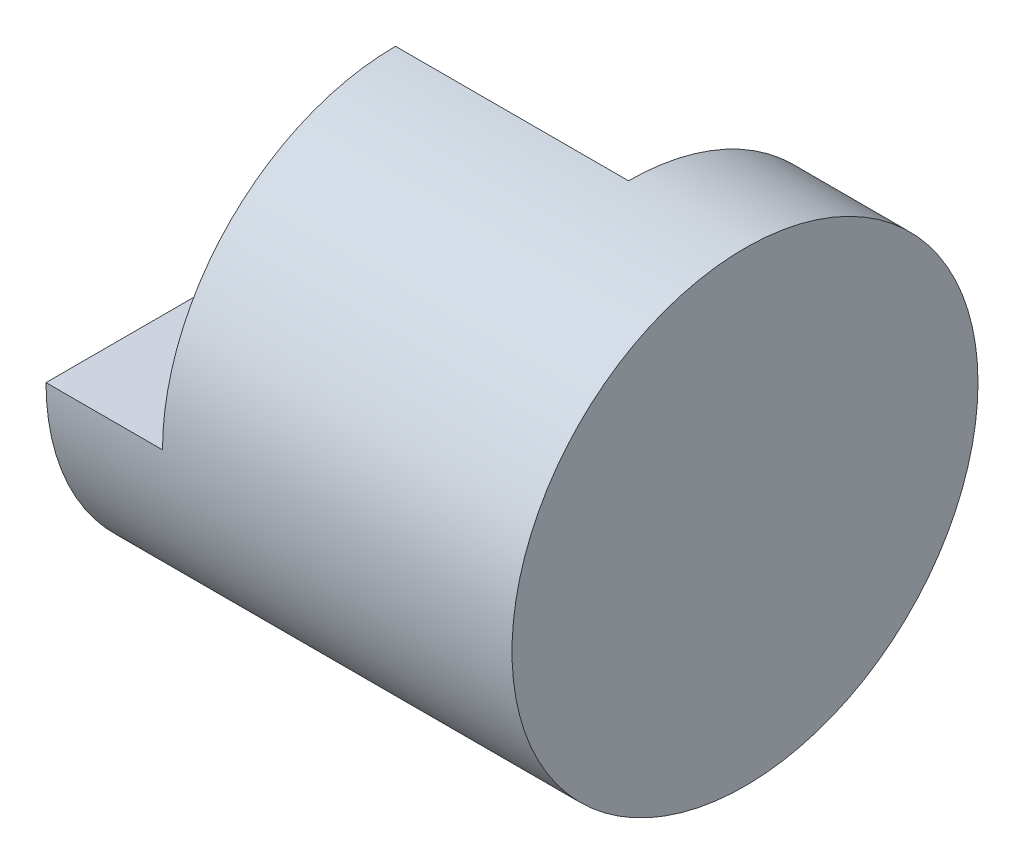
ISO-10303-21;
HEADER;
FILE_DESCRIPTION(('STEP AP214'),'2;1');
FILE_NAME('part.step','',(''),(''),'','','');
FILE_SCHEMA(('AUTOMOTIVE_DESIGN { 1 0 10303 214 1 1 1 1 }'));
ENDSEC;
DATA;
#1=APPLICATION_CONTEXT('core data for automotive mechanical design processes');
#2=APPLICATION_PROTOCOL_DEFINITION('international standard','automotive_design',2000,#1);
#3=PRODUCT_CONTEXT('',#1,'mechanical');
#4=PRODUCT('Part','Part','',(#3));
#5=PRODUCT_RELATED_PRODUCT_CATEGORY('part','',(#4));
#6=PRODUCT_DEFINITION_FORMATION('','',#4);
#7=PRODUCT_DEFINITION_CONTEXT('part definition',#1,'design');
#8=PRODUCT_DEFINITION('design','',#6,#7);
#9=PRODUCT_DEFINITION_SHAPE('','',#8);
#10=(LENGTH_UNIT() NAMED_UNIT(*) SI_UNIT(.MILLI.,.METRE.));
#11=(NAMED_UNIT(*) PLANE_ANGLE_UNIT() SI_UNIT($,.RADIAN.));
#12=(NAMED_UNIT(*) SI_UNIT($,.STERADIAN.) SOLID_ANGLE_UNIT());
#13=UNCERTAINTY_MEASURE_WITH_UNIT(LENGTH_MEASURE(1.E-05),#10,'distance_accuracy_value','');
#14=(GEOMETRIC_REPRESENTATION_CONTEXT(3) GLOBAL_UNCERTAINTY_ASSIGNED_CONTEXT((#13)) GLOBAL_UNIT_ASSIGNED_CONTEXT((#10,
#11,#12)) REPRESENTATION_CONTEXT('',''));
#15=CARTESIAN_POINT('',(0.,0.,0.));
#16=DIRECTION('',(0.,0.,1.));
#17=DIRECTION('',(1.,0.,0.));
#18=AXIS2_PLACEMENT_3D('',#15,#16,#17);
#19=CARTESIAN_POINT('',(2.,0.,0.));
#20=DIRECTION('',(-1.,0.,0.));
#21=DIRECTION('',(0.,0.,1.));
#22=AXIS2_PLACEMENT_3D('',#19,#20,#21);
#23=CYLINDRICAL_SURFACE('',#22,2.);
#24=CARTESIAN_POINT('',(2.,0.,0.));
#25=DIRECTION('',(1.,0.,0.));
#26=DIRECTION('',(0.,0.,-1.));
#27=AXIS2_PLACEMENT_3D('',#24,#25,#26);
#28=CIRCLE('',#27,2.);
#29=CARTESIAN_POINT('',(2.,0.,-2.));
#30=VERTEX_POINT('',#29);
#31=EDGE_CURVE('E86',#30,#30,#28,.T.);
#32=ORIENTED_EDGE('',*,*,#31,.F.);
#33=EDGE_LOOP('',(#32));
#34=FACE_BOUND('',#33,.T.);
#35=DIRECTION('',(1.,0.,0.));
#36=VECTOR('',#35,1.);
#37=CARTESIAN_POINT('',(0.,0.,-2.));
#38=LINE('',#37,#36);
#39=CARTESIAN_POINT('',(-2.,0.,-2.));
#40=VERTEX_POINT('',#39);
#41=CARTESIAN_POINT('',(1.,0.,-2.));
#42=VERTEX_POINT('',#41);
#43=EDGE_CURVE('E47',#40,#42,#38,.T.);
#44=ORIENTED_EDGE('',*,*,#43,.T.);
#45=CARTESIAN_POINT('',(1.,0.,0.));
#46=DIRECTION('',(-1.,0.,0.));
#47=DIRECTION('',(0.,0.,1.));
#48=AXIS2_PLACEMENT_3D('',#45,#46,#47);
#49=CIRCLE('',#48,2.);
#50=CARTESIAN_POINT('',(1.,2.,0.));
#51=VERTEX_POINT('',#50);
#52=EDGE_CURVE('E11',#51,#42,#49,.T.);
#53=ORIENTED_EDGE('',*,*,#52,.F.);
#54=DIRECTION('',(-1.,0.,0.));
#55=VECTOR('',#54,1.);
#56=CARTESIAN_POINT('',(2.,2.,0.));
#57=LINE('',#56,#55);
#58=CARTESIAN_POINT('',(-1.,2.,0.));
#59=VERTEX_POINT('',#58);
#60=EDGE_CURVE('E40',#51,#59,#57,.T.);
#61=ORIENTED_EDGE('',*,*,#60,.T.);
#62=CARTESIAN_POINT('',(-1.,0.,0.));
#63=DIRECTION('',(1.,0.,0.));
#64=DIRECTION('',(0.,0.,-1.));
#65=AXIS2_PLACEMENT_3D('',#62,#63,#64);
#66=CIRCLE('',#65,2.);
#67=CARTESIAN_POINT('',(-1.,0.,2.));
#68=VERTEX_POINT('',#67);
#69=EDGE_CURVE('E55',#59,#68,#66,.T.);
#70=ORIENTED_EDGE('',*,*,#69,.T.);
#71=DIRECTION('',(1.,0.,0.));
#72=VECTOR('',#71,1.);
#73=CARTESIAN_POINT('',(0.,0.,2.));
#74=LINE('',#73,#72);
#75=CARTESIAN_POINT('',(-2.,0.,2.));
#76=VERTEX_POINT('',#75);
#77=EDGE_CURVE('E75',#76,#68,#74,.T.);
#78=ORIENTED_EDGE('',*,*,#77,.F.);
#79=CARTESIAN_POINT('',(-2.,0.,0.));
#80=DIRECTION('',(1.,0.,0.));
#81=DIRECTION('',(0.,0.,-1.));
#82=AXIS2_PLACEMENT_3D('',#79,#80,#81);
#83=CIRCLE('',#82,2.);
#84=EDGE_CURVE('E81',#76,#40,#83,.T.);
#85=ORIENTED_EDGE('',*,*,#84,.T.);
#86=EDGE_LOOP('',(#44,#53,#61,#70,#78,#85));
#87=FACE_BOUND('',#86,.T.);
#88=ADVANCED_FACE('F33',(#34,#87),#23,.T.);
#89=CARTESIAN_POINT('',(-2.,0.,0.));
#90=DIRECTION('',(1.,0.,0.));
#91=DIRECTION('',(0.,0.,-1.));
#92=AXIS2_PLACEMENT_3D('',#89,#90,#91);
#93=PLANE('',#92);
#94=DIRECTION('',(0.,0.,1.));
#95=VECTOR('',#94,1.);
#96=CARTESIAN_POINT('',(-2.,0.,0.));
#97=LINE('',#96,#95);
#98=EDGE_CURVE('E71',#40,#76,#97,.T.);
#99=ORIENTED_EDGE('',*,*,#98,.F.);
#100=ORIENTED_EDGE('',*,*,#84,.F.);
#101=EDGE_LOOP('',(#99,#100));
#102=FACE_BOUND('',#101,.T.);
#103=ADVANCED_FACE('F85',(#102),#93,.F.);
#104=CARTESIAN_POINT('',(2.,0.,0.));
#105=DIRECTION('',(1.,0.,0.));
#106=DIRECTION('',(0.,0.,-1.));
#107=AXIS2_PLACEMENT_3D('',#104,#105,#106);
#108=PLANE('',#107);
#109=ORIENTED_EDGE('',*,*,#31,.T.);
#110=EDGE_LOOP('',(#109));
#111=FACE_BOUND('',#110,.T.);
#112=ADVANCED_FACE('F112',(#111),#108,.T.);
#113=CARTESIAN_POINT('',(-1.,4.,0.));
#114=DIRECTION('',(1.,0.,0.));
#115=DIRECTION('',(0.,0.,-1.));
#116=AXIS2_PLACEMENT_3D('',#113,#114,#115);
#117=PLANE('',#116);
#118=DIRECTION('',(0.,-1.,0.));
#119=VECTOR('',#118,1.);
#120=CARTESIAN_POINT('',(-1.,4.,0.));
#121=LINE('',#120,#119);
#122=CARTESIAN_POINT('',(-1.,0.,0.));
#123=VERTEX_POINT('',#122);
#124=EDGE_CURVE('E87',#59,#123,#121,.T.);
#125=ORIENTED_EDGE('',*,*,#124,.T.);
#126=DIRECTION('',(0.,0.,1.));
#127=VECTOR('',#126,1.);
#128=CARTESIAN_POINT('',(-1.,0.,0.));
#129=LINE('',#128,#127);
#130=EDGE_CURVE('E83',#123,#68,#129,.T.);
#131=ORIENTED_EDGE('',*,*,#130,.T.);
#132=ORIENTED_EDGE('',*,*,#69,.F.);
#133=EDGE_LOOP('',(#125,#131,#132));
#134=FACE_BOUND('',#133,.T.);
#135=ADVANCED_FACE('F110',(#134),#117,.F.);
#136=CARTESIAN_POINT('',(0.,4.,0.));
#137=DIRECTION('',(0.,0.,1.));
#138=DIRECTION('',(1.,0.,0.));
#139=AXIS2_PLACEMENT_3D('',#136,#137,#138);
#140=PLANE('',#139);
#141=DIRECTION('',(0.,-1.,0.));
#142=VECTOR('',#141,1.);
#143=CARTESIAN_POINT('',(1.,4.,0.));
#144=LINE('',#143,#142);
#145=CARTESIAN_POINT('',(1.,0.,0.));
#146=VERTEX_POINT('',#145);
#147=EDGE_CURVE('E91',#51,#146,#144,.T.);
#148=ORIENTED_EDGE('',*,*,#147,.T.);
#149=DIRECTION('',(-1.,0.,0.));
#150=VECTOR('',#149,1.);
#151=CARTESIAN_POINT('',(0.,0.,0.));
#152=LINE('',#151,#150);
#153=EDGE_CURVE('E105',#146,#123,#152,.T.);
#154=ORIENTED_EDGE('',*,*,#153,.T.);
#155=ORIENTED_EDGE('',*,*,#124,.F.);
#156=ORIENTED_EDGE('',*,*,#60,.F.);
#157=EDGE_LOOP('',(#148,#154,#155,#156));
#158=FACE_BOUND('',#157,.T.);
#159=ADVANCED_FACE('F97',(#158),#140,.F.);
#160=CARTESIAN_POINT('',(1.,4.,0.));
#161=DIRECTION('',(-1.,0.,0.));
#162=DIRECTION('',(0.,0.,1.));
#163=AXIS2_PLACEMENT_3D('',#160,#161,#162);
#164=PLANE('',#163);
#165=ORIENTED_EDGE('',*,*,#52,.T.);
#166=DIRECTION('',(0.,0.,-1.));
#167=VECTOR('',#166,1.);
#168=CARTESIAN_POINT('',(1.,0.,0.));
#169=LINE('',#168,#167);
#170=EDGE_CURVE('E102',#146,#42,#169,.T.);
#171=ORIENTED_EDGE('',*,*,#170,.F.);
#172=ORIENTED_EDGE('',*,*,#147,.F.);
#173=EDGE_LOOP('',(#165,#171,#172));
#174=FACE_BOUND('',#173,.T.);
#175=ADVANCED_FACE('F101',(#174),#164,.T.);
#176=CARTESIAN_POINT('',(0.,0.,0.));
#177=DIRECTION('',(0.,1.,0.));
#178=DIRECTION('',(0.,0.,1.));
#179=AXIS2_PLACEMENT_3D('',#176,#177,#178);
#180=PLANE('',#179);
#181=ORIENTED_EDGE('',*,*,#43,.F.);
#182=ORIENTED_EDGE('',*,*,#98,.T.);
#183=ORIENTED_EDGE('',*,*,#77,.T.);
#184=ORIENTED_EDGE('',*,*,#130,.F.);
#185=ORIENTED_EDGE('',*,*,#153,.F.);
#186=ORIENTED_EDGE('',*,*,#170,.T.);
#187=EDGE_LOOP('',(#181,#182,#183,#184,#185,#186));
#188=FACE_BOUND('',#187,.T.);
#189=ADVANCED_FACE('F73',(#188),#180,.T.);
#190=CLOSED_SHELL('',(#88,#103,#112,#135,#159,#175,#189));
#191=MANIFOLD_SOLID_BREP('B2',#190);
#192=ADVANCED_BREP_SHAPE_REPRESENTATION('',(#18,#191),#14);
#193=SHAPE_DEFINITION_REPRESENTATION(#9,#192);
ENDSEC;
END-ISO-10303-21;
